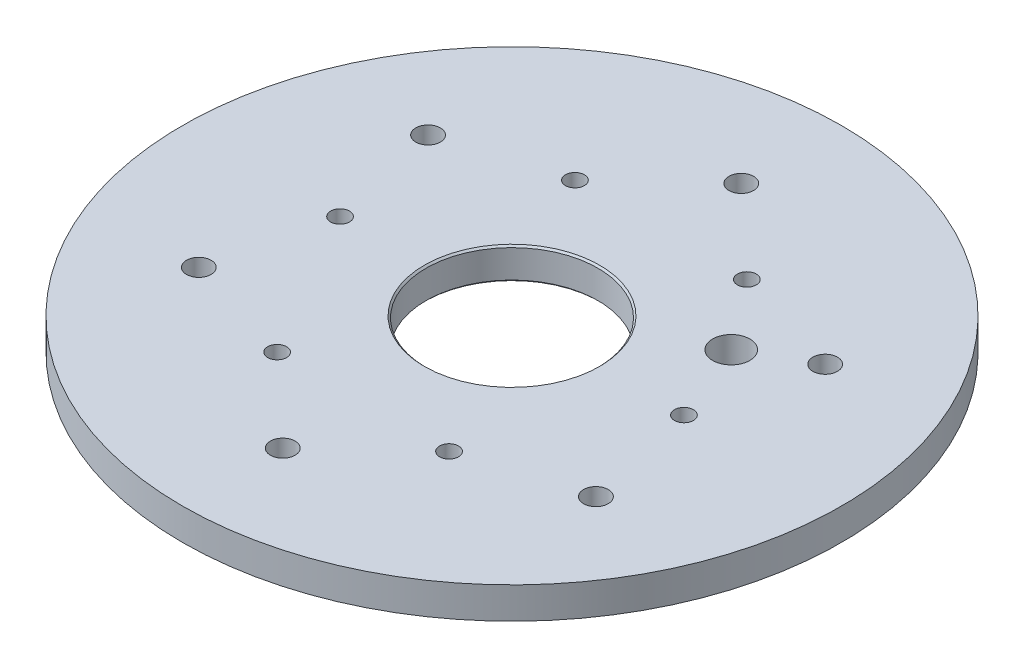
ISO-10303-21;
HEADER;
FILE_DESCRIPTION(('STEP AP214'),'2;1');
FILE_NAME('part.step','',(''),(''),'','','');
FILE_SCHEMA(('AUTOMOTIVE_DESIGN { 1 0 10303 214 1 1 1 1 }'));
ENDSEC;
DATA;
#1=APPLICATION_CONTEXT('core data for automotive mechanical design processes');
#2=APPLICATION_PROTOCOL_DEFINITION('international standard','automotive_design',2000,#1);
#3=PRODUCT_CONTEXT('',#1,'mechanical');
#4=PRODUCT('Part','Part','',(#3));
#5=PRODUCT_RELATED_PRODUCT_CATEGORY('part','',(#4));
#6=PRODUCT_DEFINITION_FORMATION('','',#4);
#7=PRODUCT_DEFINITION_CONTEXT('part definition',#1,'design');
#8=PRODUCT_DEFINITION('design','',#6,#7);
#9=PRODUCT_DEFINITION_SHAPE('','',#8);
#10=(LENGTH_UNIT() NAMED_UNIT(*) SI_UNIT(.MILLI.,.METRE.));
#11=(NAMED_UNIT(*) PLANE_ANGLE_UNIT() SI_UNIT($,.RADIAN.));
#12=(NAMED_UNIT(*) SI_UNIT($,.STERADIAN.) SOLID_ANGLE_UNIT());
#13=UNCERTAINTY_MEASURE_WITH_UNIT(LENGTH_MEASURE(1.E-05),#10,'distance_accuracy_value','');
#14=(GEOMETRIC_REPRESENTATION_CONTEXT(3) GLOBAL_UNCERTAINTY_ASSIGNED_CONTEXT((#13)) GLOBAL_UNIT_ASSIGNED_CONTEXT((#10,
#11,#12)) REPRESENTATION_CONTEXT('',''));
#15=CARTESIAN_POINT('',(0.,0.,0.));
#16=DIRECTION('',(0.,0.,1.));
#17=DIRECTION('',(1.,0.,0.));
#18=AXIS2_PLACEMENT_3D('',#15,#16,#17);
#19=CARTESIAN_POINT('',(0.,5.5,0.));
#20=DIRECTION('',(0.,1.,0.));
#21=DIRECTION('',(0.,0.,1.));
#22=AXIS2_PLACEMENT_3D('',#19,#20,#21);
#23=PLANE('',#22);
#24=CARTESIAN_POINT('',(24.2487113059634,5.5,-14.0000000000015));
#25=DIRECTION('',(0.,1.,0.));
#26=DIRECTION('',(0.,0.,1.));
#27=AXIS2_PLACEMENT_3D('',#24,#25,#26);
#28=CIRCLE('',#27,3.25);
#29=CARTESIAN_POINT('',(24.2487113059634,5.5,-10.7500000000015));
#30=VERTEX_POINT('',#29);
#31=EDGE_CURVE('E126',#30,#30,#28,.T.);
#32=ORIENTED_EDGE('',*,*,#31,.F.);
#33=EDGE_LOOP('',(#32));
#34=FACE_BOUND('',#33,.T.);
#35=CARTESIAN_POINT('',(0.,5.5,0.));
#36=DIRECTION('',(0.,1.,0.));
#37=DIRECTION('',(0.,0.,1.));
#38=AXIS2_PLACEMENT_3D('',#35,#36,#37);
#39=CIRCLE('',#38,15.3);
#40=CARTESIAN_POINT('',(0.,5.5,15.3));
#41=VERTEX_POINT('',#40);
#42=EDGE_CURVE('E10',#41,#41,#39,.F.);
#43=ORIENTED_EDGE('',*,*,#42,.T.);
#44=EDGE_LOOP('',(#43));
#45=FACE_BOUND('',#44,.T.);
#46=CARTESIAN_POINT('',(2.53020468207263E-12,5.5,40.));
#47=DIRECTION('',(0.,1.,0.));
#48=DIRECTION('',(0.,0.,1.));
#49=AXIS2_PLACEMENT_3D('',#46,#47,#48);
#50=CIRCLE('',#49,2.15);
#51=CARTESIAN_POINT('',(2.53020468207263E-12,5.5,42.15));
#52=VERTEX_POINT('',#51);
#53=EDGE_CURVE('E114',#52,#52,#50,.T.);
#54=ORIENTED_EDGE('',*,*,#53,.F.);
#55=EDGE_LOOP('',(#54));
#56=FACE_BOUND('',#55,.T.);
#57=CARTESIAN_POINT('',(34.6410161513763,5.5,-20.0000000000022));
#58=DIRECTION('',(0.,1.,0.));
#59=DIRECTION('',(0.,0.,1.));
#60=AXIS2_PLACEMENT_3D('',#57,#58,#59);
#61=CIRCLE('',#60,2.15000000000001);
#62=CARTESIAN_POINT('',(34.6410161513763,5.5,-17.8500000000022));
#63=VERTEX_POINT('',#62);
#64=EDGE_CURVE('E102',#63,#63,#61,.T.);
#65=ORIENTED_EDGE('',*,*,#64,.F.);
#66=EDGE_LOOP('',(#65));
#67=FACE_BOUND('',#66,.T.);
#68=CARTESIAN_POINT('',(-34.6410161513788,5.5,-19.9999999999978));
#69=DIRECTION('',(0.,1.,0.));
#70=DIRECTION('',(0.,0.,1.));
#71=AXIS2_PLACEMENT_3D('',#68,#69,#70);
#72=CIRCLE('',#71,2.15000000000002);
#73=CARTESIAN_POINT('',(-34.6410161513788,5.5,-17.8499999999978));
#74=VERTEX_POINT('',#73);
#75=EDGE_CURVE('E90',#74,#74,#72,.T.);
#76=ORIENTED_EDGE('',*,*,#75,.F.);
#77=EDGE_LOOP('',(#76));
#78=FACE_BOUND('',#77,.T.);
#79=CARTESIAN_POINT('',(15.,5.5,25.9807621135331));
#80=DIRECTION('',(0.,1.,0.));
#81=DIRECTION('',(0.,0.,1.));
#82=AXIS2_PLACEMENT_3D('',#79,#80,#81);
#83=CIRCLE('',#82,1.65000000000001);
#84=CARTESIAN_POINT('',(15.,5.5,27.6307621135332));
#85=VERTEX_POINT('',#84);
#86=EDGE_CURVE('E78',#85,#85,#83,.T.);
#87=ORIENTED_EDGE('',*,*,#86,.F.);
#88=EDGE_LOOP('',(#87));
#89=FACE_BOUND('',#88,.T.);
#90=CARTESIAN_POINT('',(15.,5.5,-25.9807621135332));
#91=DIRECTION('',(0.,1.,0.));
#92=DIRECTION('',(0.,0.,1.));
#93=AXIS2_PLACEMENT_3D('',#90,#91,#92);
#94=CIRCLE('',#93,1.65);
#95=CARTESIAN_POINT('',(15.,5.5,-24.3307621135332));
#96=VERTEX_POINT('',#95);
#97=EDGE_CURVE('E66',#96,#96,#94,.T.);
#98=ORIENTED_EDGE('',*,*,#97,.F.);
#99=EDGE_LOOP('',(#98));
#100=FACE_BOUND('',#99,.T.);
#101=CARTESIAN_POINT('',(0.,5.5,0.));
#102=DIRECTION('',(0.,1.,0.));
#103=DIRECTION('',(0.,0.,1.));
#104=AXIS2_PLACEMENT_3D('',#101,#102,#103);
#105=CIRCLE('',#104,57.5);
#106=CARTESIAN_POINT('',(0.,5.5,57.5));
#107=VERTEX_POINT('',#106);
#108=EDGE_CURVE('E50',#107,#107,#105,.T.);
#109=ORIENTED_EDGE('',*,*,#108,.T.);
#110=EDGE_LOOP('',(#109));
#111=FACE_BOUND('',#110,.T.);
#112=CARTESIAN_POINT('',(-30.,5.5,0.));
#113=DIRECTION('',(0.,1.,0.));
#114=DIRECTION('',(0.,0.,1.));
#115=AXIS2_PLACEMENT_3D('',#112,#113,#114);
#116=CIRCLE('',#115,1.65);
#117=CARTESIAN_POINT('',(-30.,5.5,1.65000000000001));
#118=VERTEX_POINT('',#117);
#119=EDGE_CURVE('E54',#118,#118,#116,.T.);
#120=ORIENTED_EDGE('',*,*,#119,.F.);
#121=EDGE_LOOP('',(#120));
#122=FACE_BOUND('',#121,.T.);
#123=CARTESIAN_POINT('',(-15.,5.5,-25.9807621135332));
#124=DIRECTION('',(0.,1.,0.));
#125=DIRECTION('',(0.,0.,1.));
#126=AXIS2_PLACEMENT_3D('',#123,#124,#125);
#127=CIRCLE('',#126,1.65000000000001);
#128=CARTESIAN_POINT('',(-15.,5.5,-24.3307621135331));
#129=VERTEX_POINT('',#128);
#130=EDGE_CURVE('E60',#129,#129,#127,.T.);
#131=ORIENTED_EDGE('',*,*,#130,.F.);
#132=EDGE_LOOP('',(#131));
#133=FACE_BOUND('',#132,.T.);
#134=CARTESIAN_POINT('',(30.,5.5,0.));
#135=DIRECTION('',(0.,1.,0.));
#136=DIRECTION('',(0.,0.,1.));
#137=AXIS2_PLACEMENT_3D('',#134,#135,#136);
#138=CIRCLE('',#137,1.65);
#139=CARTESIAN_POINT('',(30.,5.5,1.65));
#140=VERTEX_POINT('',#139);
#141=EDGE_CURVE('E72',#140,#140,#138,.T.);
#142=ORIENTED_EDGE('',*,*,#141,.F.);
#143=EDGE_LOOP('',(#142));
#144=FACE_BOUND('',#143,.T.);
#145=CARTESIAN_POINT('',(-15.,5.5,25.9807621135332));
#146=DIRECTION('',(0.,1.,0.));
#147=DIRECTION('',(0.,0.,1.));
#148=AXIS2_PLACEMENT_3D('',#145,#146,#147);
#149=CIRCLE('',#148,1.65);
#150=CARTESIAN_POINT('',(-15.,5.5,27.6307621135332));
#151=VERTEX_POINT('',#150);
#152=EDGE_CURVE('E84',#151,#151,#149,.T.);
#153=ORIENTED_EDGE('',*,*,#152,.F.);
#154=EDGE_LOOP('',(#153));
#155=FACE_BOUND('',#154,.T.);
#156=CARTESIAN_POINT('',(-2.51627867567533E-12,5.5,-40.));
#157=DIRECTION('',(0.,1.,0.));
#158=DIRECTION('',(0.,0.,1.));
#159=AXIS2_PLACEMENT_3D('',#156,#157,#158);
#160=CIRCLE('',#159,2.15);
#161=CARTESIAN_POINT('',(-2.51627867567533E-12,5.5,-37.85));
#162=VERTEX_POINT('',#161);
#163=EDGE_CURVE('E96',#162,#162,#160,.T.);
#164=ORIENTED_EDGE('',*,*,#163,.F.);
#165=EDGE_LOOP('',(#164));
#166=FACE_BOUND('',#165,.T.);
#167=CARTESIAN_POINT('',(34.6410161513788,5.5,19.9999999999978));
#168=DIRECTION('',(0.,1.,0.));
#169=DIRECTION('',(0.,0.,1.));
#170=AXIS2_PLACEMENT_3D('',#167,#168,#169);
#171=CIRCLE('',#170,2.15000000000001);
#172=CARTESIAN_POINT('',(34.6410161513788,5.5,22.1499999999978));
#173=VERTEX_POINT('',#172);
#174=EDGE_CURVE('E108',#173,#173,#171,.T.);
#175=ORIENTED_EDGE('',*,*,#174,.F.);
#176=EDGE_LOOP('',(#175));
#177=FACE_BOUND('',#176,.T.);
#178=CARTESIAN_POINT('',(-34.6410161513763,5.5,20.0000000000022));
#179=DIRECTION('',(0.,1.,0.));
#180=DIRECTION('',(0.,0.,1.));
#181=AXIS2_PLACEMENT_3D('',#178,#179,#180);
#182=CIRCLE('',#181,2.15);
#183=CARTESIAN_POINT('',(-34.6410161513763,5.5,22.1500000000022));
#184=VERTEX_POINT('',#183);
#185=EDGE_CURVE('E120',#184,#184,#182,.T.);
#186=ORIENTED_EDGE('',*,*,#185,.F.);
#187=EDGE_LOOP('',(#186));
#188=FACE_BOUND('',#187,.T.);
#189=ADVANCED_FACE('F30',(#34,#45,#56,#67,#78,#89,#100,#111,#122,#133,#144,#155,#166,#177,#188),
#23,.T.);
#190=CARTESIAN_POINT('',(0.,0.,0.));
#191=DIRECTION('',(0.,1.,0.));
#192=DIRECTION('',(0.,0.,1.));
#193=AXIS2_PLACEMENT_3D('',#190,#191,#192);
#194=PLANE('',#193);
#195=CARTESIAN_POINT('',(24.2487113059634,0.,-14.0000000000015));
#196=DIRECTION('',(0.,-1.,0.));
#197=DIRECTION('',(0.,0.,-1.));
#198=AXIS2_PLACEMENT_3D('',#195,#196,#197);
#199=CIRCLE('',#198,3.25);
#200=CARTESIAN_POINT('',(24.2487113059634,0.,-17.2500000000015));
#201=VERTEX_POINT('',#200);
#202=EDGE_CURVE('E131',#201,#201,#199,.T.);
#203=ORIENTED_EDGE('',*,*,#202,.F.);
#204=EDGE_LOOP('',(#203));
#205=FACE_BOUND('',#204,.T.);
#206=CARTESIAN_POINT('',(0.,0.,0.));
#207=DIRECTION('',(0.,1.,0.));
#208=DIRECTION('',(0.,0.,1.));
#209=AXIS2_PLACEMENT_3D('',#206,#207,#208);
#210=CIRCLE('',#209,15.3);
#211=CARTESIAN_POINT('',(0.,0.,15.3));
#212=VERTEX_POINT('',#211);
#213=EDGE_CURVE('E45',#212,#212,#210,.T.);
#214=ORIENTED_EDGE('',*,*,#213,.T.);
#215=EDGE_LOOP('',(#214));
#216=FACE_BOUND('',#215,.T.);
#217=CARTESIAN_POINT('',(0.,0.,0.));
#218=DIRECTION('',(0.,1.,0.));
#219=DIRECTION('',(0.,0.,1.));
#220=AXIS2_PLACEMENT_3D('',#217,#218,#219);
#221=CIRCLE('',#220,57.5);
#222=CARTESIAN_POINT('',(0.,0.,57.5));
#223=VERTEX_POINT('',#222);
#224=EDGE_CURVE('E51',#223,#223,#221,.T.);
#225=ORIENTED_EDGE('',*,*,#224,.F.);
#226=EDGE_LOOP('',(#225));
#227=FACE_BOUND('',#226,.T.);
#228=CARTESIAN_POINT('',(-30.,0.,0.));
#229=DIRECTION('',(0.,1.,0.));
#230=DIRECTION('',(0.,0.,1.));
#231=AXIS2_PLACEMENT_3D('',#228,#229,#230);
#232=CIRCLE('',#231,1.65);
#233=CARTESIAN_POINT('',(-30.,0.,1.65000000000001));
#234=VERTEX_POINT('',#233);
#235=EDGE_CURVE('E57',#234,#234,#232,.T.);
#236=ORIENTED_EDGE('',*,*,#235,.T.);
#237=EDGE_LOOP('',(#236));
#238=FACE_BOUND('',#237,.T.);
#239=CARTESIAN_POINT('',(-15.,0.,-25.9807621135332));
#240=DIRECTION('',(0.,1.,0.));
#241=DIRECTION('',(0.,0.,1.));
#242=AXIS2_PLACEMENT_3D('',#239,#240,#241);
#243=CIRCLE('',#242,1.65000000000001);
#244=CARTESIAN_POINT('',(-15.,0.,-24.3307621135331));
#245=VERTEX_POINT('',#244);
#246=EDGE_CURVE('E63',#245,#245,#243,.T.);
#247=ORIENTED_EDGE('',*,*,#246,.T.);
#248=EDGE_LOOP('',(#247));
#249=FACE_BOUND('',#248,.T.);
#250=CARTESIAN_POINT('',(15.,0.,-25.9807621135332));
#251=DIRECTION('',(0.,1.,0.));
#252=DIRECTION('',(0.,0.,1.));
#253=AXIS2_PLACEMENT_3D('',#250,#251,#252);
#254=CIRCLE('',#253,1.65);
#255=CARTESIAN_POINT('',(15.,0.,-24.3307621135332));
#256=VERTEX_POINT('',#255);
#257=EDGE_CURVE('E69',#256,#256,#254,.T.);
#258=ORIENTED_EDGE('',*,*,#257,.T.);
#259=EDGE_LOOP('',(#258));
#260=FACE_BOUND('',#259,.T.);
#261=CARTESIAN_POINT('',(30.,0.,0.));
#262=DIRECTION('',(0.,1.,0.));
#263=DIRECTION('',(0.,0.,1.));
#264=AXIS2_PLACEMENT_3D('',#261,#262,#263);
#265=CIRCLE('',#264,1.65);
#266=CARTESIAN_POINT('',(30.,0.,1.65));
#267=VERTEX_POINT('',#266);
#268=EDGE_CURVE('E75',#267,#267,#265,.T.);
#269=ORIENTED_EDGE('',*,*,#268,.T.);
#270=EDGE_LOOP('',(#269));
#271=FACE_BOUND('',#270,.T.);
#272=CARTESIAN_POINT('',(15.,0.,25.9807621135331));
#273=DIRECTION('',(0.,1.,0.));
#274=DIRECTION('',(0.,0.,1.));
#275=AXIS2_PLACEMENT_3D('',#272,#273,#274);
#276=CIRCLE('',#275,1.65000000000001);
#277=CARTESIAN_POINT('',(15.,0.,27.6307621135332));
#278=VERTEX_POINT('',#277);
#279=EDGE_CURVE('E81',#278,#278,#276,.T.);
#280=ORIENTED_EDGE('',*,*,#279,.T.);
#281=EDGE_LOOP('',(#280));
#282=FACE_BOUND('',#281,.T.);
#283=CARTESIAN_POINT('',(-15.,0.,25.9807621135332));
#284=DIRECTION('',(0.,1.,0.));
#285=DIRECTION('',(0.,0.,1.));
#286=AXIS2_PLACEMENT_3D('',#283,#284,#285);
#287=CIRCLE('',#286,1.65);
#288=CARTESIAN_POINT('',(-15.,0.,27.6307621135332));
#289=VERTEX_POINT('',#288);
#290=EDGE_CURVE('E87',#289,#289,#287,.T.);
#291=ORIENTED_EDGE('',*,*,#290,.T.);
#292=EDGE_LOOP('',(#291));
#293=FACE_BOUND('',#292,.T.);
#294=CARTESIAN_POINT('',(-34.6410161513788,0.,-19.9999999999978));
#295=DIRECTION('',(0.,1.,0.));
#296=DIRECTION('',(0.,0.,1.));
#297=AXIS2_PLACEMENT_3D('',#294,#295,#296);
#298=CIRCLE('',#297,2.15000000000002);
#299=CARTESIAN_POINT('',(-34.6410161513788,0.,-17.8499999999978));
#300=VERTEX_POINT('',#299);
#301=EDGE_CURVE('E93',#300,#300,#298,.T.);
#302=ORIENTED_EDGE('',*,*,#301,.T.);
#303=EDGE_LOOP('',(#302));
#304=FACE_BOUND('',#303,.T.);
#305=CARTESIAN_POINT('',(-2.51627867567533E-12,0.,-40.));
#306=DIRECTION('',(0.,1.,0.));
#307=DIRECTION('',(0.,0.,1.));
#308=AXIS2_PLACEMENT_3D('',#305,#306,#307);
#309=CIRCLE('',#308,2.15);
#310=CARTESIAN_POINT('',(-2.51627867567533E-12,0.,-37.85));
#311=VERTEX_POINT('',#310);
#312=EDGE_CURVE('E99',#311,#311,#309,.T.);
#313=ORIENTED_EDGE('',*,*,#312,.T.);
#314=EDGE_LOOP('',(#313));
#315=FACE_BOUND('',#314,.T.);
#316=CARTESIAN_POINT('',(34.6410161513763,0.,-20.0000000000022));
#317=DIRECTION('',(0.,1.,0.));
#318=DIRECTION('',(0.,0.,1.));
#319=AXIS2_PLACEMENT_3D('',#316,#317,#318);
#320=CIRCLE('',#319,2.15000000000001);
#321=CARTESIAN_POINT('',(34.6410161513763,0.,-17.8500000000022));
#322=VERTEX_POINT('',#321);
#323=EDGE_CURVE('E105',#322,#322,#320,.T.);
#324=ORIENTED_EDGE('',*,*,#323,.T.);
#325=EDGE_LOOP('',(#324));
#326=FACE_BOUND('',#325,.T.);
#327=CARTESIAN_POINT('',(34.6410161513788,0.,19.9999999999978));
#328=DIRECTION('',(0.,1.,0.));
#329=DIRECTION('',(0.,0.,1.));
#330=AXIS2_PLACEMENT_3D('',#327,#328,#329);
#331=CIRCLE('',#330,2.15000000000001);
#332=CARTESIAN_POINT('',(34.6410161513788,0.,22.1499999999978));
#333=VERTEX_POINT('',#332);
#334=EDGE_CURVE('E111',#333,#333,#331,.T.);
#335=ORIENTED_EDGE('',*,*,#334,.T.);
#336=EDGE_LOOP('',(#335));
#337=FACE_BOUND('',#336,.T.);
#338=CARTESIAN_POINT('',(2.53020468207263E-12,0.,40.));
#339=DIRECTION('',(0.,1.,0.));
#340=DIRECTION('',(0.,0.,1.));
#341=AXIS2_PLACEMENT_3D('',#338,#339,#340);
#342=CIRCLE('',#341,2.15);
#343=CARTESIAN_POINT('',(2.53020468207263E-12,0.,42.15));
#344=VERTEX_POINT('',#343);
#345=EDGE_CURVE('E117',#344,#344,#342,.T.);
#346=ORIENTED_EDGE('',*,*,#345,.T.);
#347=EDGE_LOOP('',(#346));
#348=FACE_BOUND('',#347,.T.);
#349=CARTESIAN_POINT('',(-34.6410161513763,0.,20.0000000000022));
#350=DIRECTION('',(0.,1.,0.));
#351=DIRECTION('',(0.,0.,1.));
#352=AXIS2_PLACEMENT_3D('',#349,#350,#351);
#353=CIRCLE('',#352,2.15);
#354=CARTESIAN_POINT('',(-34.6410161513763,0.,22.1500000000022));
#355=VERTEX_POINT('',#354);
#356=EDGE_CURVE('E123',#355,#355,#353,.T.);
#357=ORIENTED_EDGE('',*,*,#356,.T.);
#358=EDGE_LOOP('',(#357));
#359=FACE_BOUND('',#358,.T.);
#360=ADVANCED_FACE('F137',(#205,#216,#227,#238,#249,#260,#271,#282,#293,#304,#315,#326,#337,
#348,#359),#194,.F.);
#361=CARTESIAN_POINT('',(0.,5.5,0.));
#362=DIRECTION('',(0.,-1.,0.));
#363=DIRECTION('',(0.,0.,-1.));
#364=AXIS2_PLACEMENT_3D('',#361,#362,#363);
#365=CYLINDRICAL_SURFACE('',#364,57.5);
#366=ORIENTED_EDGE('',*,*,#108,.F.);
#367=EDGE_LOOP('',(#366));
#368=FACE_BOUND('',#367,.T.);
#369=ORIENTED_EDGE('',*,*,#224,.T.);
#370=EDGE_LOOP('',(#369));
#371=FACE_BOUND('',#370,.T.);
#372=ADVANCED_FACE('F140',(#368,#371),#365,.T.);
#373=CARTESIAN_POINT('',(-30.,5.5,0.));
#374=DIRECTION('',(0.,-1.,0.));
#375=DIRECTION('',(0.,0.,-1.));
#376=AXIS2_PLACEMENT_3D('',#373,#374,#375);
#377=CYLINDRICAL_SURFACE('',#376,1.65);
#378=ORIENTED_EDGE('',*,*,#119,.T.);
#379=EDGE_LOOP('',(#378));
#380=FACE_BOUND('',#379,.T.);
#381=ORIENTED_EDGE('',*,*,#235,.F.);
#382=EDGE_LOOP('',(#381));
#383=FACE_BOUND('',#382,.T.);
#384=ADVANCED_FACE('F192',(#380,#383),#377,.F.);
#385=CARTESIAN_POINT('',(0.,5.5,0.));
#386=DIRECTION('',(0.,-1.,0.));
#387=DIRECTION('',(0.,0.,-1.));
#388=AXIS2_PLACEMENT_3D('',#385,#386,#387);
#389=CYLINDRICAL_SURFACE('',#388,15.);
#390=CARTESIAN_POINT('',(0.,0.30000000000001,0.));
#391=DIRECTION('',(0.,1.,0.));
#392=DIRECTION('',(0.,0.,1.));
#393=AXIS2_PLACEMENT_3D('',#390,#391,#392);
#394=CIRCLE('',#393,15.);
#395=CARTESIAN_POINT('',(0.,0.30000000000001,15.));
#396=VERTEX_POINT('',#395);
#397=EDGE_CURVE('E37',#396,#396,#394,.F.);
#398=ORIENTED_EDGE('',*,*,#397,.T.);
#399=EDGE_LOOP('',(#398));
#400=FACE_BOUND('',#399,.T.);
#401=CARTESIAN_POINT('',(0.,5.20000000000003,0.));
#402=DIRECTION('',(0.,1.,0.));
#403=DIRECTION('',(0.,0.,1.));
#404=AXIS2_PLACEMENT_3D('',#401,#402,#403);
#405=CIRCLE('',#404,15.);
#406=CARTESIAN_POINT('',(0.,5.20000000000003,15.));
#407=VERTEX_POINT('',#406);
#408=EDGE_CURVE('E41',#407,#407,#405,.T.);
#409=ORIENTED_EDGE('',*,*,#408,.T.);
#410=EDGE_LOOP('',(#409));
#411=FACE_BOUND('',#410,.T.);
#412=ADVANCED_FACE('F200',(#400,#411),#389,.F.);
#413=CARTESIAN_POINT('',(-15.,5.5,-25.9807621135332));
#414=DIRECTION('',(0.,-1.,0.));
#415=DIRECTION('',(0.,0.,-1.));
#416=AXIS2_PLACEMENT_3D('',#413,#414,#415);
#417=CYLINDRICAL_SURFACE('',#416,1.65000000000001);
#418=ORIENTED_EDGE('',*,*,#130,.T.);
#419=EDGE_LOOP('',(#418));
#420=FACE_BOUND('',#419,.T.);
#421=ORIENTED_EDGE('',*,*,#246,.F.);
#422=EDGE_LOOP('',(#421));
#423=FACE_BOUND('',#422,.T.);
#424=ADVANCED_FACE('F253',(#420,#423),#417,.F.);
#425=CARTESIAN_POINT('',(15.,5.5,-25.9807621135332));
#426=DIRECTION('',(0.,-1.,0.));
#427=DIRECTION('',(0.,0.,-1.));
#428=AXIS2_PLACEMENT_3D('',#425,#426,#427);
#429=CYLINDRICAL_SURFACE('',#428,1.65);
#430=ORIENTED_EDGE('',*,*,#97,.T.);
#431=EDGE_LOOP('',(#430));
#432=FACE_BOUND('',#431,.T.);
#433=ORIENTED_EDGE('',*,*,#257,.F.);
#434=EDGE_LOOP('',(#433));
#435=FACE_BOUND('',#434,.T.);
#436=ADVANCED_FACE('F249',(#432,#435),#429,.F.);
#437=CARTESIAN_POINT('',(30.,5.5,0.));
#438=DIRECTION('',(0.,-1.,0.));
#439=DIRECTION('',(0.,0.,-1.));
#440=AXIS2_PLACEMENT_3D('',#437,#438,#439);
#441=CYLINDRICAL_SURFACE('',#440,1.65);
#442=ORIENTED_EDGE('',*,*,#141,.T.);
#443=EDGE_LOOP('',(#442));
#444=FACE_BOUND('',#443,.T.);
#445=ORIENTED_EDGE('',*,*,#268,.F.);
#446=EDGE_LOOP('',(#445));
#447=FACE_BOUND('',#446,.T.);
#448=ADVANCED_FACE('F245',(#444,#447),#441,.F.);
#449=CARTESIAN_POINT('',(15.,5.5,25.9807621135331));
#450=DIRECTION('',(0.,-1.,0.));
#451=DIRECTION('',(0.,0.,-1.));
#452=AXIS2_PLACEMENT_3D('',#449,#450,#451);
#453=CYLINDRICAL_SURFACE('',#452,1.65000000000001);
#454=ORIENTED_EDGE('',*,*,#86,.T.);
#455=EDGE_LOOP('',(#454));
#456=FACE_BOUND('',#455,.T.);
#457=ORIENTED_EDGE('',*,*,#279,.F.);
#458=EDGE_LOOP('',(#457));
#459=FACE_BOUND('',#458,.T.);
#460=ADVANCED_FACE('F241',(#456,#459),#453,.F.);
#461=CARTESIAN_POINT('',(-15.,5.5,25.9807621135332));
#462=DIRECTION('',(0.,-1.,0.));
#463=DIRECTION('',(0.,0.,-1.));
#464=AXIS2_PLACEMENT_3D('',#461,#462,#463);
#465=CYLINDRICAL_SURFACE('',#464,1.65);
#466=ORIENTED_EDGE('',*,*,#152,.T.);
#467=EDGE_LOOP('',(#466));
#468=FACE_BOUND('',#467,.T.);
#469=ORIENTED_EDGE('',*,*,#290,.F.);
#470=EDGE_LOOP('',(#469));
#471=FACE_BOUND('',#470,.T.);
#472=ADVANCED_FACE('F237',(#468,#471),#465,.F.);
#473=CARTESIAN_POINT('',(-34.6410161513788,5.5,-19.9999999999978));
#474=DIRECTION('',(0.,-1.,0.));
#475=DIRECTION('',(0.,0.,-1.));
#476=AXIS2_PLACEMENT_3D('',#473,#474,#475);
#477=CYLINDRICAL_SURFACE('',#476,2.15000000000002);
#478=ORIENTED_EDGE('',*,*,#75,.T.);
#479=EDGE_LOOP('',(#478));
#480=FACE_BOUND('',#479,.T.);
#481=ORIENTED_EDGE('',*,*,#301,.F.);
#482=EDGE_LOOP('',(#481));
#483=FACE_BOUND('',#482,.T.);
#484=ADVANCED_FACE('F233',(#480,#483),#477,.F.);
#485=CARTESIAN_POINT('',(-2.51627867567533E-12,5.5,-40.));
#486=DIRECTION('',(0.,-1.,0.));
#487=DIRECTION('',(0.,0.,-1.));
#488=AXIS2_PLACEMENT_3D('',#485,#486,#487);
#489=CYLINDRICAL_SURFACE('',#488,2.15);
#490=ORIENTED_EDGE('',*,*,#163,.T.);
#491=EDGE_LOOP('',(#490));
#492=FACE_BOUND('',#491,.T.);
#493=ORIENTED_EDGE('',*,*,#312,.F.);
#494=EDGE_LOOP('',(#493));
#495=FACE_BOUND('',#494,.T.);
#496=ADVANCED_FACE('F227',(#492,#495),#489,.F.);
#497=CARTESIAN_POINT('',(34.6410161513763,5.5,-20.0000000000022));
#498=DIRECTION('',(0.,-1.,0.));
#499=DIRECTION('',(0.,0.,-1.));
#500=AXIS2_PLACEMENT_3D('',#497,#498,#499);
#501=CYLINDRICAL_SURFACE('',#500,2.15000000000001);
#502=ORIENTED_EDGE('',*,*,#64,.T.);
#503=EDGE_LOOP('',(#502));
#504=FACE_BOUND('',#503,.T.);
#505=ORIENTED_EDGE('',*,*,#323,.F.);
#506=EDGE_LOOP('',(#505));
#507=FACE_BOUND('',#506,.T.);
#508=ADVANCED_FACE('F222',(#504,#507),#501,.F.);
#509=CARTESIAN_POINT('',(34.6410161513788,5.5,19.9999999999978));
#510=DIRECTION('',(0.,-1.,0.));
#511=DIRECTION('',(0.,0.,-1.));
#512=AXIS2_PLACEMENT_3D('',#509,#510,#511);
#513=CYLINDRICAL_SURFACE('',#512,2.15000000000001);
#514=ORIENTED_EDGE('',*,*,#174,.T.);
#515=EDGE_LOOP('',(#514));
#516=FACE_BOUND('',#515,.T.);
#517=ORIENTED_EDGE('',*,*,#334,.F.);
#518=EDGE_LOOP('',(#517));
#519=FACE_BOUND('',#518,.T.);
#520=ADVANCED_FACE('F181',(#516,#519),#513,.F.);
#521=CARTESIAN_POINT('',(2.53020468207263E-12,5.5,40.));
#522=DIRECTION('',(0.,-1.,0.));
#523=DIRECTION('',(0.,0.,-1.));
#524=AXIS2_PLACEMENT_3D('',#521,#522,#523);
#525=CYLINDRICAL_SURFACE('',#524,2.15);
#526=ORIENTED_EDGE('',*,*,#53,.T.);
#527=EDGE_LOOP('',(#526));
#528=FACE_BOUND('',#527,.T.);
#529=ORIENTED_EDGE('',*,*,#345,.F.);
#530=EDGE_LOOP('',(#529));
#531=FACE_BOUND('',#530,.T.);
#532=ADVANCED_FACE('F173',(#528,#531),#525,.F.);
#533=CARTESIAN_POINT('',(-34.6410161513763,5.5,20.0000000000022));
#534=DIRECTION('',(0.,-1.,0.));
#535=DIRECTION('',(0.,0.,-1.));
#536=AXIS2_PLACEMENT_3D('',#533,#534,#535);
#537=CYLINDRICAL_SURFACE('',#536,2.15);
#538=ORIENTED_EDGE('',*,*,#185,.T.);
#539=EDGE_LOOP('',(#538));
#540=FACE_BOUND('',#539,.T.);
#541=ORIENTED_EDGE('',*,*,#356,.F.);
#542=EDGE_LOOP('',(#541));
#543=FACE_BOUND('',#542,.T.);
#544=ADVANCED_FACE('F170',(#540,#543),#537,.F.);
#545=CARTESIAN_POINT('',(0.,0.,0.));
#546=DIRECTION('',(0.,-1.,0.));
#547=DIRECTION('',(0.,0.,-1.));
#548=AXIS2_PLACEMENT_3D('',#545,#546,#547);
#549=CONICAL_SURFACE('',#548,15.3,0.785398163397445);
#550=ORIENTED_EDGE('',*,*,#397,.F.);
#551=EDGE_LOOP('',(#550));
#552=FACE_BOUND('',#551,.T.);
#553=ORIENTED_EDGE('',*,*,#213,.F.);
#554=EDGE_LOOP('',(#553));
#555=FACE_BOUND('',#554,.T.);
#556=ADVANCED_FACE('F172',(#552,#555),#549,.F.);
#557=CARTESIAN_POINT('',(0.,5.20000000000003,0.));
#558=DIRECTION('',(0.,1.,0.));
#559=DIRECTION('',(0.,0.,1.));
#560=AXIS2_PLACEMENT_3D('',#557,#558,#559);
#561=CONICAL_SURFACE('',#560,15.,0.78539816339744);
#562=ORIENTED_EDGE('',*,*,#42,.F.);
#563=EDGE_LOOP('',(#562));
#564=FACE_BOUND('',#563,.T.);
#565=ORIENTED_EDGE('',*,*,#408,.F.);
#566=EDGE_LOOP('',(#565));
#567=FACE_BOUND('',#566,.T.);
#568=ADVANCED_FACE('F32',(#564,#567),#561,.F.);
#569=CARTESIAN_POINT('',(24.2487113059634,10.,-14.0000000000015));
#570=DIRECTION('',(0.,-1.,0.));
#571=DIRECTION('',(0.,0.,-1.));
#572=AXIS2_PLACEMENT_3D('',#569,#570,#571);
#573=CYLINDRICAL_SURFACE('',#572,3.25);
#574=ORIENTED_EDGE('',*,*,#31,.T.);
#575=EDGE_LOOP('',(#574));
#576=FACE_BOUND('',#575,.T.);
#577=ORIENTED_EDGE('',*,*,#202,.T.);
#578=EDGE_LOOP('',(#577));
#579=FACE_BOUND('',#578,.T.);
#580=ADVANCED_FACE('F135',(#576,#579),#573,.F.);
#581=CLOSED_SHELL('',(#189,#360,#372,#384,#412,#424,#436,#448,#460,#472,#484,#496,#508,#520,
#532,#544,#556,#568,#580));
#582=MANIFOLD_SOLID_BREP('B2',#581);
#583=ADVANCED_BREP_SHAPE_REPRESENTATION('',(#18,#582),#14);
#584=SHAPE_DEFINITION_REPRESENTATION(#9,#583);
ENDSEC;
END-ISO-10303-21;
